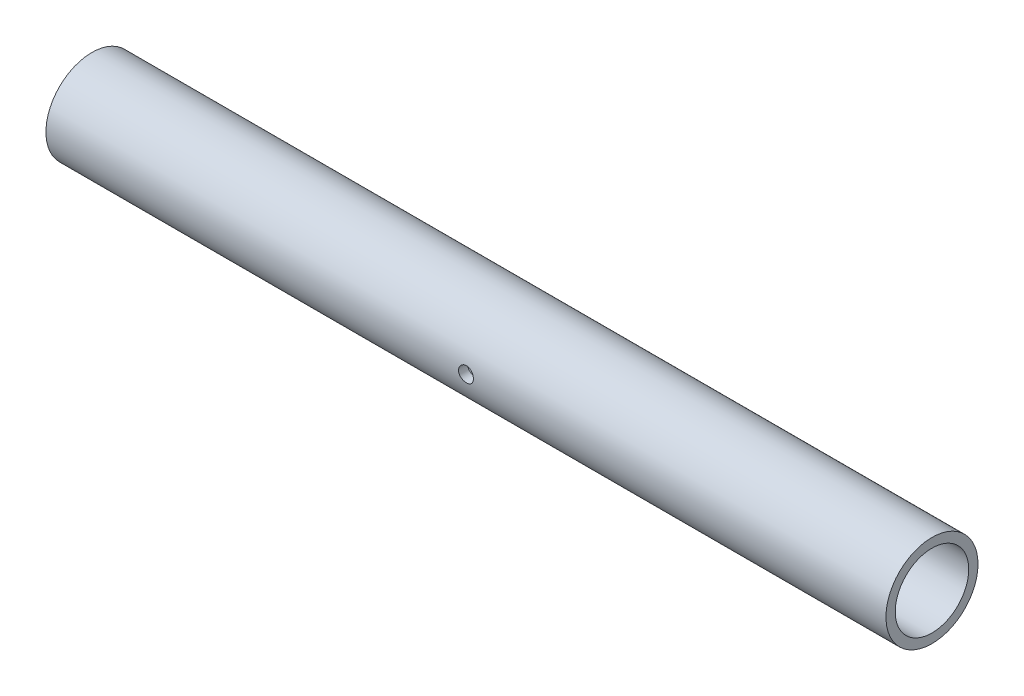
ISO-10303-21;
HEADER;
FILE_DESCRIPTION(('STEP AP214'),'2;1');
FILE_NAME('part.step','',(''),(''),'','','');
FILE_SCHEMA(('AUTOMOTIVE_DESIGN { 1 0 10303 214 1 1 1 1 }'));
ENDSEC;
DATA;
#1=APPLICATION_CONTEXT('core data for automotive mechanical design processes');
#2=APPLICATION_PROTOCOL_DEFINITION('international standard','automotive_design',2000,#1);
#3=PRODUCT_CONTEXT('',#1,'mechanical');
#4=PRODUCT('Part','Part','',(#3));
#5=PRODUCT_RELATED_PRODUCT_CATEGORY('part','',(#4));
#6=PRODUCT_DEFINITION_FORMATION('','',#4);
#7=PRODUCT_DEFINITION_CONTEXT('part definition',#1,'design');
#8=PRODUCT_DEFINITION('design','',#6,#7);
#9=PRODUCT_DEFINITION_SHAPE('','',#8);
#10=(LENGTH_UNIT() NAMED_UNIT(*) SI_UNIT(.MILLI.,.METRE.));
#11=(NAMED_UNIT(*) PLANE_ANGLE_UNIT() SI_UNIT($,.RADIAN.));
#12=(NAMED_UNIT(*) SI_UNIT($,.STERADIAN.) SOLID_ANGLE_UNIT());
#13=UNCERTAINTY_MEASURE_WITH_UNIT(LENGTH_MEASURE(1.E-05),#10,'distance_accuracy_value','');
#14=(GEOMETRIC_REPRESENTATION_CONTEXT(3) GLOBAL_UNCERTAINTY_ASSIGNED_CONTEXT((#13)) GLOBAL_UNIT_ASSIGNED_CONTEXT((#10,
#11,#12)) REPRESENTATION_CONTEXT('',''));
#15=CARTESIAN_POINT('',(0.,0.,0.));
#16=DIRECTION('',(0.,0.,1.));
#17=DIRECTION('',(1.,0.,0.));
#18=AXIS2_PLACEMENT_3D('',#15,#16,#17);
#19=CARTESIAN_POINT('',(304.8,0.,0.));
#20=DIRECTION('',(1.,0.,0.));
#21=DIRECTION('',(0.,0.,-1.));
#22=AXIS2_PLACEMENT_3D('',#19,#20,#21);
#23=PLANE('',#22);
#24=CARTESIAN_POINT('',(304.8,0.,0.));
#25=DIRECTION('',(1.,0.,0.));
#26=DIRECTION('',(0.,0.,-1.));
#27=AXIS2_PLACEMENT_3D('',#24,#25,#26);
#28=CIRCLE('',#27,16.7005);
#29=CARTESIAN_POINT('',(304.8,0.,-16.7005));
#30=VERTEX_POINT('',#29);
#31=EDGE_CURVE('E10',#30,#30,#28,.T.);
#32=ORIENTED_EDGE('',*,*,#31,.T.);
#33=EDGE_LOOP('',(#32));
#34=FACE_BOUND('',#33,.T.);
#35=CARTESIAN_POINT('',(304.8,0.,0.));
#36=DIRECTION('',(1.,0.,0.));
#37=DIRECTION('',(0.,0.,-1.));
#38=AXIS2_PLACEMENT_3D('',#35,#36,#37);
#39=CIRCLE('',#38,13.335);
#40=CARTESIAN_POINT('',(304.8,0.,-13.335));
#41=VERTEX_POINT('',#40);
#42=EDGE_CURVE('E53',#41,#41,#39,.T.);
#43=ORIENTED_EDGE('',*,*,#42,.F.);
#44=EDGE_LOOP('',(#43));
#45=FACE_BOUND('',#44,.T.);
#46=ADVANCED_FACE('F41',(#34,#45),#23,.T.);
#47=CARTESIAN_POINT('',(0.,0.,0.));
#48=DIRECTION('',(1.,0.,0.));
#49=DIRECTION('',(0.,0.,-1.));
#50=AXIS2_PLACEMENT_3D('',#47,#48,#49);
#51=PLANE('',#50);
#52=CARTESIAN_POINT('',(0.,0.,0.));
#53=DIRECTION('',(1.,0.,0.));
#54=DIRECTION('',(0.,0.,-1.));
#55=AXIS2_PLACEMENT_3D('',#52,#53,#54);
#56=CIRCLE('',#55,16.7005);
#57=CARTESIAN_POINT('',(0.,0.,-16.7005));
#58=VERTEX_POINT('',#57);
#59=EDGE_CURVE('E46',#58,#58,#56,.T.);
#60=ORIENTED_EDGE('',*,*,#59,.F.);
#61=EDGE_LOOP('',(#60));
#62=FACE_BOUND('',#61,.T.);
#63=CARTESIAN_POINT('',(0.,0.,0.));
#64=DIRECTION('',(1.,0.,0.));
#65=DIRECTION('',(0.,0.,-1.));
#66=AXIS2_PLACEMENT_3D('',#63,#64,#65);
#67=CIRCLE('',#66,13.335);
#68=CARTESIAN_POINT('',(0.,0.,-13.335));
#69=VERTEX_POINT('',#68);
#70=EDGE_CURVE('E55',#69,#69,#67,.T.);
#71=ORIENTED_EDGE('',*,*,#70,.T.);
#72=EDGE_LOOP('',(#71));
#73=FACE_BOUND('',#72,.T.);
#74=ADVANCED_FACE('F84',(#62,#73),#51,.F.);
#75=CARTESIAN_POINT('',(304.8,0.,0.));
#76=DIRECTION('',(-1.,0.,0.));
#77=DIRECTION('',(0.,0.,1.));
#78=AXIS2_PLACEMENT_3D('',#75,#76,#77);
#79=CYLINDRICAL_SURFACE('',#78,16.7005);
#80=CARTESIAN_POINT('',(155.1051,0.,16.7005));
#81=CARTESIAN_POINT('',(155.105093897087,-0.150888062548303,16.7004974577365));
#82=CARTESIAN_POINT('',(155.092432758379,-0.301859994666066,16.6984337641219));
#83=CARTESIAN_POINT('',(155.042141383676,-0.599573765303217,16.6903999723937));
#84=CARTESIAN_POINT('',(155.004487792628,-0.746311513080885,16.6844262204648));
#85=CARTESIAN_POINT('',(154.90537472287,-1.0312061766267,16.6692427211351));
#86=CARTESIAN_POINT('',(154.843934287842,-1.16936985436145,16.6600355629369));
#87=CARTESIAN_POINT('',(154.699040513581,-1.43340829062403,16.6393990707399));
#88=CARTESIAN_POINT('',(154.615589848481,-1.55928453946972,16.6279700067358));
#89=CARTESIAN_POINT('',(154.428240590823,-1.79633294529008,16.6040421740029));
#90=CARTESIAN_POINT('',(154.324181856033,-1.90737774983379,16.591535491026));
#91=CARTESIAN_POINT('',(154.098914989324,-2.1105114085896,16.5669229733114));
#92=CARTESIAN_POINT('',(153.977705804489,-2.20259909811607,16.5548171632407));
#93=CARTESIAN_POINT('',(153.720709403468,-2.36571066174806,16.5323003820462));
#94=CARTESIAN_POINT('',(153.58484178218,-2.43660938550688,16.521899638475));
#95=CARTESIAN_POINT('',(153.302929431016,-2.55453030416696,16.5040799174436));
#96=CARTESIAN_POINT('',(153.156885350204,-2.60155402025599,16.4966607500196));
#97=CARTESIAN_POINT('',(152.860112716242,-2.66999048982907,16.4857227198729));
#98=CARTESIAN_POINT('',(152.709435998324,-2.69162258951269,16.4821704723586));
#99=CARTESIAN_POINT('',(152.406552768084,-2.70934168919743,16.4792673895096));
#100=CARTESIAN_POINT('',(152.254346358719,-2.70543039707,16.4799162732805));
#101=CARTESIAN_POINT('',(151.954285356396,-2.67235257585698,16.4853116422221));
#102=CARTESIAN_POINT('',(151.806402847489,-2.64343183378623,16.4900182476923));
#103=CARTESIAN_POINT('',(151.517617291042,-2.56154150799834,16.502936357017));
#104=CARTESIAN_POINT('',(151.37671447089,-2.50857114134623,16.5111479749766));
#105=CARTESIAN_POINT('',(151.105148697648,-2.37983413536215,16.5301942305314));
#106=CARTESIAN_POINT('',(150.974535269656,-2.30396483733819,16.5410406365502));
#107=CARTESIAN_POINT('',(150.727800002518,-2.13165657059765,16.5641260861383));
#108=CARTESIAN_POINT('',(150.611679270523,-2.03521603188844,16.5763652359683));
#109=CARTESIAN_POINT('',(150.395802387933,-1.82316079178855,16.6010326457947));
#110=CARTESIAN_POINT('',(150.296253457762,-1.70733507940944,16.6134614436807));
#111=CARTESIAN_POINT('',(150.117973519348,-1.46051261763989,16.6369752748997));
#112=CARTESIAN_POINT('',(150.039242631801,-1.32951578029888,16.6480603004418));
#113=CARTESIAN_POINT('',(149.904817203808,-1.05587919110396,16.6676520858549));
#114=CARTESIAN_POINT('',(149.849140292661,-0.913230628642439,16.6761568713015));
#115=CARTESIAN_POINT('',(149.762592033457,-0.620439017931161,16.689613888894));
#116=CARTESIAN_POINT('',(149.731718726758,-0.470296562439258,16.6945664015455));
#117=CARTESIAN_POINT('',(149.695933402982,-0.16856590589134,16.7003233068798));
#118=CARTESIAN_POINT('',(149.690736794805,-0.0170122941565777,16.7011731693918));
#119=CARTESIAN_POINT('',(149.705694623299,0.284800682339517,16.6987533332108));
#120=CARTESIAN_POINT('',(149.725848140432,0.435060093846976,16.6954837839433));
#121=CARTESIAN_POINT('',(149.79069743882,0.729145269491143,16.6852206333956));
#122=CARTESIAN_POINT('',(149.835252978216,0.873002765566383,16.6782483193063));
#123=CARTESIAN_POINT('',(149.947492520573,1.15120604540566,16.6613584524574));
#124=CARTESIAN_POINT('',(150.015177761857,1.28555131943812,16.6514407420105));
#125=CARTESIAN_POINT('',(150.172411794106,1.54215720864201,16.629647987126));
#126=CARTESIAN_POINT('',(150.262139161391,1.66430704194941,16.6177572269374));
#127=CARTESIAN_POINT('',(150.460663902427,1.89191696449165,16.5933865628871));
#128=CARTESIAN_POINT('',(150.569462579924,1.99737591177163,16.5809066187905));
#129=CARTESIAN_POINT('',(150.804315231753,2.18965975513515,16.5566179523259));
#130=CARTESIAN_POINT('',(150.93052720777,2.27629280016818,16.5448169671038));
#131=CARTESIAN_POINT('',(151.195879626388,2.42712761732702,16.5233646792845));
#132=CARTESIAN_POINT('',(151.335019675855,2.49133007126879,16.5137133113492));
#133=CARTESIAN_POINT('',(151.62173175804,2.59519124980596,16.4977104952734));
#134=CARTESIAN_POINT('',(151.769267861794,2.6349470586088,16.4913460103877));
#135=CARTESIAN_POINT('',(152.069034939324,2.68909299931143,16.4826042915982));
#136=CARTESIAN_POINT('',(152.221265528669,2.70348520265564,16.4802267320832));
#137=CARTESIAN_POINT('',(152.524185617428,2.70644008511556,16.4797415544371));
#138=CARTESIAN_POINT('',(152.674872177798,2.69530464320214,16.4815840317318));
#139=CARTESIAN_POINT('',(152.972198053532,2.64817138492831,16.4892222214147));
#140=CARTESIAN_POINT('',(153.118837379963,2.61217363655834,16.4950179229922));
#141=CARTESIAN_POINT('',(153.403799112764,2.51645069874717,16.5098910068696));
#142=CARTESIAN_POINT('',(153.542129961818,2.45675008128221,16.5189649898099));
#143=CARTESIAN_POINT('',(153.806861126234,2.31534678208125,16.5393757512933));
#144=CARTESIAN_POINT('',(153.933260903651,2.23364310891717,16.5507126317935));
#145=CARTESIAN_POINT('',(154.172069631771,2.0494698849786,16.5745306822589));
#146=CARTESIAN_POINT('',(154.284305840065,1.94677779193518,16.5870232561983));
#147=CARTESIAN_POINT('',(154.490057277457,1.72401256578686,16.6116529092408));
#148=CARTESIAN_POINT('',(154.583568172536,1.60393541992531,16.6237899054911));
#149=CARTESIAN_POINT('',(154.749765732965,1.34888505958874,16.6464318057398));
#150=CARTESIAN_POINT('',(154.822313353884,1.21382025362174,16.6569256097812));
#151=CARTESIAN_POINT('',(154.943580335504,0.933308987477759,16.6749905845962));
#152=CARTESIAN_POINT('',(154.992323705429,0.787873158058099,16.6825646985689));
#153=CARTESIAN_POINT('',(155.053878589069,0.534871671086589,16.6922617563775));
#154=CARTESIAN_POINT('',(155.073056270392,0.428846028496355,16.6953347747841));
#155=CARTESIAN_POINT('',(155.098669052378,0.215227800139453,16.6994547874161));
#156=CARTESIAN_POINT('',(155.105104353482,0.107635239047601,16.7005018135109));
#157=CARTESIAN_POINT('',(155.1051,0.,16.7005));
#158=B_SPLINE_CURVE_WITH_KNOTS('',3,(#80,#81,#82,#83,#84,#85,#86,#87,#88,#89,#90,#91,#92,#93,
#94,#95,#96,#97,#98,#99,#100,#101,#102,#103,#104,#105,#106,#107,#108,#109,#110,#111,#112,#113,
#114,#115,#116,#117,#118,#119,#120,#121,#122,#123,#124,#125,#126,#127,#128,#129,#130,#131,#132,
#133,#134,#135,#136,#137,#138,#139,#140,#141,#142,#143,#144,#145,#146,#147,#148,#149,#150,#151,
#152,#153,#154,#155,#156,#157),.UNSPECIFIED.,.T.,.F.,(4,2,2,2,2,2,2,2,2,2,2,2,2,2,2,2,2,2,2,2,2,
2,2,2,2,2,2,2,2,2,2,2,2,2,2,2,2,2,4),(0.,0.452270787216408,0.904964810512096,1.35729715518357,
1.80957456901735,2.26551517452944,2.72148378372722,3.18009458772586,3.63867616782943,
4.09326642255645,4.54782628297365,4.9979689596137,5.44812629168908,5.90033249063431,
6.35257321421474,6.81010181368963,7.26763306569815,7.7255135470429,8.18335786781695,
8.63611604666351,9.08885780285638,9.53902448404456,9.98921527009213,10.4431811075173,
10.8971779909038,11.3556045004122,11.8140170740548,12.2705972081985,12.7271400517363,
13.1783119065942,13.6294825276468,14.0801866512621,14.5309110863978,14.9866887137601,
15.4425717103213,15.9014124875041,16.3597895122137,16.6824196742317,17.0050447611613),.UNSPECIFIED.);
#159=CARTESIAN_POINT('',(155.1051,0.,16.7005));
#160=VERTEX_POINT('',#159);
#161=EDGE_CURVE('E58',#160,#160,#158,.T.);
#162=ORIENTED_EDGE('',*,*,#161,.T.);
#163=EDGE_LOOP('',(#162));
#164=FACE_BOUND('',#163,.T.);
#165=ORIENTED_EDGE('',*,*,#31,.F.);
#166=EDGE_LOOP('',(#165));
#167=FACE_BOUND('',#166,.T.);
#168=ORIENTED_EDGE('',*,*,#59,.T.);
#169=EDGE_LOOP('',(#168));
#170=FACE_BOUND('',#169,.T.);
#171=ADVANCED_FACE('F43',(#164,#167,#170),#79,.T.);
#172=CARTESIAN_POINT('',(304.8,0.,0.));
#173=DIRECTION('',(-1.,0.,0.));
#174=DIRECTION('',(0.,0.,1.));
#175=AXIS2_PLACEMENT_3D('',#172,#173,#174);
#176=CYLINDRICAL_SURFACE('',#175,13.335);
#177=CARTESIAN_POINT('',(155.1051,0.,13.335));
#178=CARTESIAN_POINT('',(155.105094525376,-0.150295600484553,13.3349972242289));
#179=CARTESIAN_POINT('',(155.092532026992,-0.300659946654723,13.3324330403292));
#180=CARTESIAN_POINT('',(155.0426556573,-0.597135385188636,13.3224513830455));
#181=CARTESIAN_POINT('',(155.00532241314,-0.743243055026255,13.3150301110628));
#182=CARTESIAN_POINT('',(154.907107787482,-1.02687601225216,13.296162618508));
#183=CARTESIAN_POINT('',(154.84624926408,-1.16440948049959,13.2847203059164));
#184=CARTESIAN_POINT('',(154.702780252209,-1.4273047577558,13.2590533011895));
#185=CARTESIAN_POINT('',(154.620170950095,-1.55266723009767,13.2448287608163));
#186=CARTESIAN_POINT('',(154.434327195231,-1.7894149071107,13.2149405065597));
#187=CARTESIAN_POINT('',(154.330848481905,-1.9006064034824,13.199261063324));
#188=CARTESIAN_POINT('',(154.106728265231,-2.10417816613857,13.168344071895));
#189=CARTESIAN_POINT('',(153.986085396097,-2.19655693403454,13.1531065589832));
#190=CARTESIAN_POINT('',(153.729662382321,-2.36070988620932,13.1246448707219));
#191=CARTESIAN_POINT('',(153.593750860226,-2.43228266379821,13.1114409219455));
#192=CARTESIAN_POINT('',(153.311518766293,-2.55150142471515,13.0887651113974));
#193=CARTESIAN_POINT('',(153.165199255873,-2.59914984389556,13.0792928697041));
#194=CARTESIAN_POINT('',(152.868391357684,-2.6685367944566,13.0653122596412));
#195=CARTESIAN_POINT('',(152.717985662028,-2.69061565322798,13.0607387529412));
#196=CARTESIAN_POINT('',(152.415540625344,-2.70929399940926,13.0568774442569));
#197=CARTESIAN_POINT('',(152.263501457958,-2.70589616880503,13.0575890858936));
#198=CARTESIAN_POINT('',(151.964601070229,-2.67399255726,13.0641585153922));
#199=CARTESIAN_POINT('',(151.817696102583,-2.64587767366682,13.0699361809375));
#200=CARTESIAN_POINT('',(151.530732268451,-2.56595538643003,13.0858604269536));
#201=CARTESIAN_POINT('',(151.390673737762,-2.51414682197339,13.0960072214775));
#202=CARTESIAN_POINT('',(151.120256078371,-2.38793669722346,13.1196079166759));
#203=CARTESIAN_POINT('',(150.989970984035,-2.31338088418128,13.1330842731062));
#204=CARTESIAN_POINT('',(150.74361439873,-2.14390140848478,13.1618113260375));
#205=CARTESIAN_POINT('',(150.627544588842,-2.04897534051733,13.1770622319794));
#206=CARTESIAN_POINT('',(150.410658529072,-1.83936052489874,13.207966610656));
#207=CARTESIAN_POINT('',(150.310164588826,-1.72433832876226,13.2236223079897));
#208=CARTESIAN_POINT('',(150.129845547073,-1.47890259644831,13.2533138361505));
#209=CARTESIAN_POINT('',(150.050020725472,-1.34848885186894,13.2673496450393));
#210=CARTESIAN_POINT('',(149.913243309945,-1.07560877370192,13.2922559746792));
#211=CARTESIAN_POINT('',(149.856328351573,-0.9331230696536,13.3031212790442));
#212=CARTESIAN_POINT('',(149.767334173484,-0.640342655170266,13.3204229182029));
#213=CARTESIAN_POINT('',(149.735251857011,-0.490048920930976,13.3268598052313));
#214=CARTESIAN_POINT('',(149.697291809661,-0.188687712334038,13.3345021896925));
#215=CARTESIAN_POINT('',(149.69097311446,-0.037677946869132,13.3357957101814));
#216=CARTESIAN_POINT('',(149.703530978531,0.263239556156422,13.3332504287549));
#217=CARTESIAN_POINT('',(149.722406078805,0.413147357027401,13.32941192404));
#218=CARTESIAN_POINT('',(149.784449478553,0.706177355722136,13.3170890419464));
#219=CARTESIAN_POINT('',(149.827390777664,0.849349603396196,13.3086480961947));
#220=CARTESIAN_POINT('',(149.936098999973,1.12646132397948,13.2880635649464));
#221=CARTESIAN_POINT('',(150.001867669613,1.26040008952707,13.2759196961607));
#222=CARTESIAN_POINT('',(150.1553124641,1.51709720534946,13.249057435921));
#223=CARTESIAN_POINT('',(150.243253128819,1.63969417441024,13.234308651375));
#224=CARTESIAN_POINT('',(150.438192261469,1.86854925612131,13.2039425775509));
#225=CARTESIAN_POINT('',(150.545192835727,1.97480556053181,13.1883251924146));
#226=CARTESIAN_POINT('',(150.777224325758,2.16967113581846,13.1576842969314));
#227=CARTESIAN_POINT('',(150.902511858808,2.2579772780275,13.1426739537023));
#228=CARTESIAN_POINT('',(151.166400440108,2.41229295069217,13.1152291615274));
#229=CARTESIAN_POINT('',(151.305000947602,2.47830338628301,13.1027946080206));
#230=CARTESIAN_POINT('',(151.590874470357,2.58574384042946,13.0820163622959));
#231=CARTESIAN_POINT('',(151.738097250659,2.62730316903986,13.0736511905723));
#232=CARTESIAN_POINT('',(152.037624714809,2.68505210426675,13.0619142618958));
#233=CARTESIAN_POINT('',(152.189928711529,2.70124512705367,13.058541832556));
#234=CARTESIAN_POINT('',(152.492249983923,2.70767252503984,13.0572103103202));
#235=CARTESIAN_POINT('',(152.642256835453,2.69838611838186,13.0591512812084));
#236=CARTESIAN_POINT('',(152.938522306478,2.65517792546284,13.0680041721845));
#237=CARTESIAN_POINT('',(153.084780958013,2.62125634986901,13.0749160497637));
#238=CARTESIAN_POINT('',(153.369082210092,2.52995717578002,13.0928866727968));
#239=CARTESIAN_POINT('',(153.507144922099,2.47263996377305,13.1039347363055));
#240=CARTESIAN_POINT('',(153.771768617197,2.33623222267459,13.1289386922158));
#241=CARTESIAN_POINT('',(153.898328599311,2.25713980109381,13.1428948373339));
#242=CARTESIAN_POINT('',(154.138737028366,2.07779697949024,13.1724471666242));
#243=CARTESIAN_POINT('',(154.252324843556,1.97720115843756,13.188067738479));
#244=CARTESIAN_POINT('',(154.461166037052,1.75841835754841,13.2190155313656));
#245=CARTESIAN_POINT('',(154.556415194048,1.64022733861366,13.2343426841269));
#246=CARTESIAN_POINT('',(154.726850865077,1.38807123157175,13.2631724688158));
#247=CARTESIAN_POINT('',(154.801809092012,1.25394927014427,13.276653559364));
#248=CARTESIAN_POINT('',(154.928003538366,0.974774923026418,13.3000597177516));
#249=CARTESIAN_POINT('',(154.97926092306,0.829732424717033,13.3099879565525));
#250=CARTESIAN_POINT('',(155.046787117943,0.570324604330927,13.3232639467522));
#251=CARTESIAN_POINT('',(155.068615067119,0.45742586083621,13.327638992893));
#252=CARTESIAN_POINT('',(155.097773357139,0.22969808726299,13.3335080319502));
#253=CARTESIAN_POINT('',(155.10510418419,0.114869122050805,13.3350021214885));
#254=CARTESIAN_POINT('',(155.1051,0.,13.335));
#255=B_SPLINE_CURVE_WITH_KNOTS('',3,(#177,#178,#179,#180,#181,#182,#183,#184,#185,#186,#187,
#188,#189,#190,#191,#192,#193,#194,#195,#196,#197,#198,#199,#200,#201,#202,#203,#204,#205,#206,
#207,#208,#209,#210,#211,#212,#213,#214,#215,#216,#217,#218,#219,#220,#221,#222,#223,#224,#225,
#226,#227,#228,#229,#230,#231,#232,#233,#234,#235,#236,#237,#238,#239,#240,#241,#242,#243,#244,
#245,#246,#247,#248,#249,#250,#251,#252,#253,#254),.UNSPECIFIED.,.T.,.F.,(4,2,2,2,2,2,2,2,2,2,2,
2,2,2,2,2,2,2,2,2,2,2,2,2,2,2,2,2,2,2,2,2,2,2,2,2,2,2,4),(0.,0.450466540959125,
0.901285801401294,1.35166812455106,1.80202588755751,2.25799744724725,2.71400530978153,
3.17429068540293,3.63452918768033,4.0885689020244,4.54256081930287,4.98949951624589,
5.43646011218639,5.88652164703375,6.33663635427288,6.79508725203935,7.25354435795345,
7.71275155793441,8.1719014832478,8.62315884642445,9.07439007798768,9.52143509257741,
9.96851431656822,10.4212035028349,10.8739427471937,11.3337873895974,11.7936133615181,
12.2509851539842,12.7082953452709,13.1570636849492,13.6058281870383,14.0534416345438,
14.501093996541,14.9565651472641,15.4121410161987,15.8726474155708,16.3327417764777,
16.677039489884,17.0213256559887),.UNSPECIFIED.);
#256=CARTESIAN_POINT('',(155.1051,0.,13.335));
#257=VERTEX_POINT('',#256);
#258=EDGE_CURVE('E67',#257,#257,#255,.T.);
#259=ORIENTED_EDGE('',*,*,#258,.F.);
#260=EDGE_LOOP('',(#259));
#261=FACE_BOUND('',#260,.T.);
#262=ORIENTED_EDGE('',*,*,#42,.T.);
#263=EDGE_LOOP('',(#262));
#264=FACE_BOUND('',#263,.T.);
#265=ORIENTED_EDGE('',*,*,#70,.F.);
#266=EDGE_LOOP('',(#265));
#267=FACE_BOUND('',#266,.T.);
#268=ADVANCED_FACE('F75',(#261,#264,#267),#176,.F.);
#269=CARTESIAN_POINT('',(152.4,0.,16.7005));
#270=DIRECTION('',(0.,0.,1.));
#271=DIRECTION('',(1.,0.,0.));
#272=AXIS2_PLACEMENT_3D('',#269,#270,#271);
#273=CYLINDRICAL_SURFACE('',#272,2.70509999999999);
#274=ORIENTED_EDGE('',*,*,#258,.T.);
#275=EDGE_LOOP('',(#274));
#276=FACE_BOUND('',#275,.T.);
#277=ORIENTED_EDGE('',*,*,#161,.F.);
#278=EDGE_LOOP('',(#277));
#279=FACE_BOUND('',#278,.T.);
#280=ADVANCED_FACE('F72',(#276,#279),#273,.F.);
#281=CLOSED_SHELL('',(#46,#74,#171,#268,#280));
#282=MANIFOLD_SOLID_BREP('B2',#281);
#283=ADVANCED_BREP_SHAPE_REPRESENTATION('',(#18,#282),#14);
#284=SHAPE_DEFINITION_REPRESENTATION(#9,#283);
ENDSEC;
END-ISO-10303-21;
